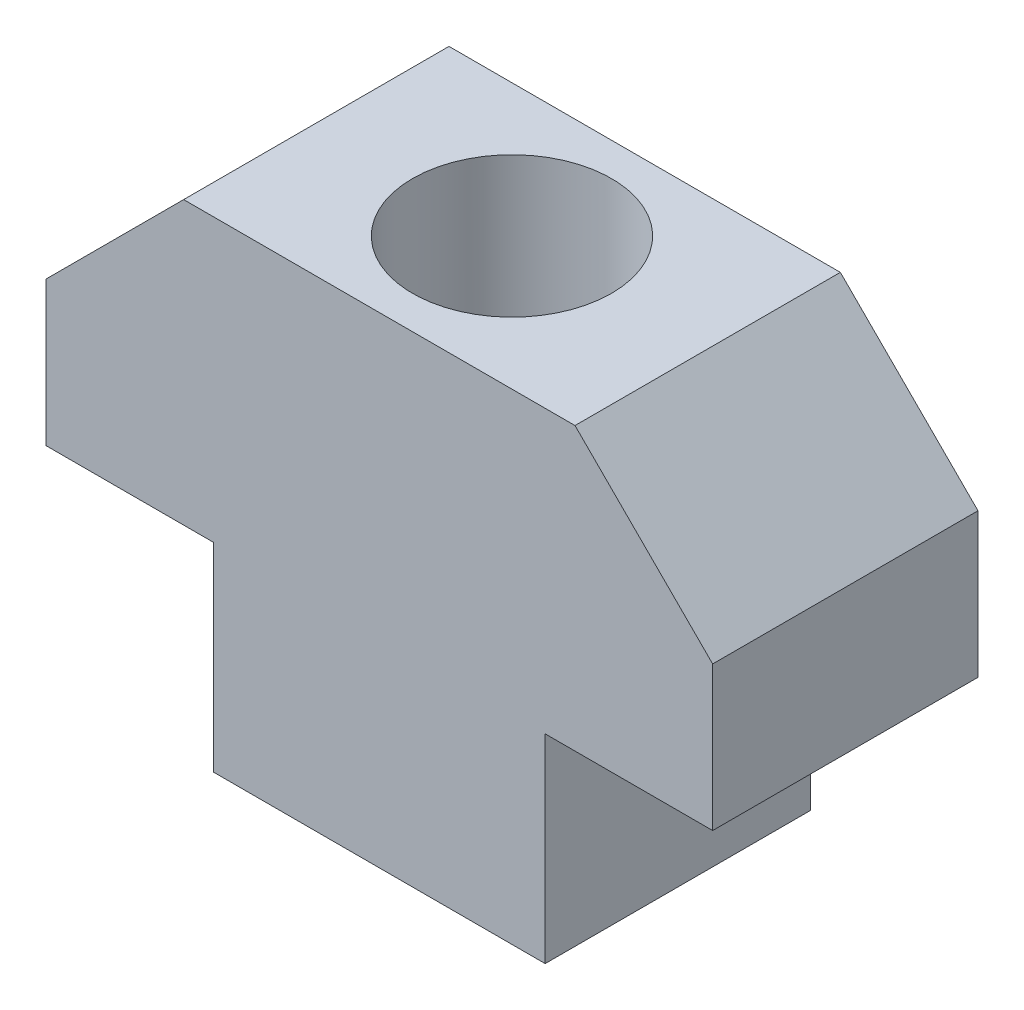
ISO-10303-21;
HEADER;
FILE_DESCRIPTION(('STEP AP214'),'2;1');
FILE_NAME('part.step','',(''),(''),'','','');
FILE_SCHEMA(('AUTOMOTIVE_DESIGN { 1 0 10303 214 1 1 1 1 }'));
ENDSEC;
DATA;
#1=APPLICATION_CONTEXT('core data for automotive mechanical design processes');
#2=APPLICATION_PROTOCOL_DEFINITION('international standard','automotive_design',2000,#1);
#3=PRODUCT_CONTEXT('',#1,'mechanical');
#4=PRODUCT('Part','Part','',(#3));
#5=PRODUCT_RELATED_PRODUCT_CATEGORY('part','',(#4));
#6=PRODUCT_DEFINITION_FORMATION('','',#4);
#7=PRODUCT_DEFINITION_CONTEXT('part definition',#1,'design');
#8=PRODUCT_DEFINITION('design','',#6,#7);
#9=PRODUCT_DEFINITION_SHAPE('','',#8);
#10=(LENGTH_UNIT() NAMED_UNIT(*) SI_UNIT(.MILLI.,.METRE.));
#11=(NAMED_UNIT(*) PLANE_ANGLE_UNIT() SI_UNIT($,.RADIAN.));
#12=(NAMED_UNIT(*) SI_UNIT($,.STERADIAN.) SOLID_ANGLE_UNIT());
#13=UNCERTAINTY_MEASURE_WITH_UNIT(LENGTH_MEASURE(1.E-05),#10,'distance_accuracy_value','');
#14=(GEOMETRIC_REPRESENTATION_CONTEXT(3) GLOBAL_UNCERTAINTY_ASSIGNED_CONTEXT((#13)) GLOBAL_UNIT_ASSIGNED_CONTEXT((#10,
#11,#12)) REPRESENTATION_CONTEXT('',''));
#15=CARTESIAN_POINT('',(0.,0.,0.));
#16=DIRECTION('',(0.,0.,1.));
#17=DIRECTION('',(1.,0.,0.));
#18=AXIS2_PLACEMENT_3D('',#15,#16,#17);
#19=CARTESIAN_POINT('',(5.9,14.5,4.));
#20=DIRECTION('',(0.,-1.,0.));
#21=DIRECTION('',(1.,0.,0.));
#22=AXIS2_PLACEMENT_3D('',#19,#20,#21);
#23=PLANE('',#22);
#24=DIRECTION('',(-1.,0.,0.));
#25=VECTOR('',#24,1.);
#26=CARTESIAN_POINT('',(5.9,14.5,-4.));
#27=LINE('',#26,#25);
#28=CARTESIAN_POINT('',(5.9,14.5,-4.));
#29=VERTEX_POINT('',#28);
#30=CARTESIAN_POINT('',(-5.9,14.5,-4.));
#31=VERTEX_POINT('',#30);
#32=EDGE_CURVE('E154',#29,#31,#27,.T.);
#33=ORIENTED_EDGE('',*,*,#32,.T.);
#34=DIRECTION('',(0.,0.,-1.));
#35=VECTOR('',#34,1.);
#36=CARTESIAN_POINT('',(-5.9,14.5,4.));
#37=LINE('',#36,#35);
#38=CARTESIAN_POINT('',(-5.9,14.5,4.));
#39=VERTEX_POINT('',#38);
#40=EDGE_CURVE('E170',#39,#31,#37,.T.);
#41=ORIENTED_EDGE('',*,*,#40,.F.);
#42=DIRECTION('',(-1.,0.,0.));
#43=VECTOR('',#42,1.);
#44=CARTESIAN_POINT('',(5.9,14.5,4.));
#45=LINE('',#44,#43);
#46=CARTESIAN_POINT('',(5.9,14.5,4.));
#47=VERTEX_POINT('',#46);
#48=EDGE_CURVE('E199',#47,#39,#45,.T.);
#49=ORIENTED_EDGE('',*,*,#48,.F.);
#50=DIRECTION('',(0.,0.,-1.));
#51=VECTOR('',#50,1.);
#52=CARTESIAN_POINT('',(5.9,14.5,4.));
#53=LINE('',#52,#51);
#54=EDGE_CURVE('E173',#47,#29,#53,.T.);
#55=ORIENTED_EDGE('',*,*,#54,.T.);
#56=EDGE_LOOP('',(#33,#41,#49,#55));
#57=FACE_BOUND('',#56,.T.);
#58=CARTESIAN_POINT('',(0.,14.5,0.));
#59=DIRECTION('',(0.,-1.,0.));
#60=DIRECTION('',(1.,0.,0.));
#61=AXIS2_PLACEMENT_3D('',#58,#59,#60);
#62=CIRCLE('',#61,3.);
#63=CARTESIAN_POINT('',(3.,14.5,0.));
#64=VERTEX_POINT('',#63);
#65=EDGE_CURVE('E210',#64,#64,#62,.T.);
#66=ORIENTED_EDGE('',*,*,#65,.T.);
#67=EDGE_LOOP('',(#66));
#68=FACE_BOUND('',#67,.T.);
#69=ADVANCED_FACE('F35',(#57,#68),#23,.F.);
#70=CARTESIAN_POINT('',(-5.,0.,4.));
#71=DIRECTION('',(0.,1.,0.));
#72=DIRECTION('',(-1.,0.,0.));
#73=AXIS2_PLACEMENT_3D('',#70,#71,#72);
#74=PLANE('',#73);
#75=DIRECTION('',(1.,0.,0.));
#76=VECTOR('',#75,1.);
#77=CARTESIAN_POINT('',(-5.,0.,-4.));
#78=LINE('',#77,#76);
#79=CARTESIAN_POINT('',(-5.,0.,-4.));
#80=VERTEX_POINT('',#79);
#81=CARTESIAN_POINT('',(5.,0.,-4.));
#82=VERTEX_POINT('',#81);
#83=EDGE_CURVE('E93',#80,#82,#78,.T.);
#84=ORIENTED_EDGE('',*,*,#83,.T.);
#85=DIRECTION('',(0.,0.,-1.));
#86=VECTOR('',#85,1.);
#87=CARTESIAN_POINT('',(5.,0.,4.));
#88=LINE('',#87,#86);
#89=CARTESIAN_POINT('',(5.,0.,4.));
#90=VERTEX_POINT('',#89);
#91=EDGE_CURVE('E140',#90,#82,#88,.T.);
#92=ORIENTED_EDGE('',*,*,#91,.F.);
#93=DIRECTION('',(1.,0.,0.));
#94=VECTOR('',#93,1.);
#95=CARTESIAN_POINT('',(-5.,0.,4.));
#96=LINE('',#95,#94);
#97=CARTESIAN_POINT('',(-5.,0.,4.));
#98=VERTEX_POINT('',#97);
#99=EDGE_CURVE('E52',#98,#90,#96,.T.);
#100=ORIENTED_EDGE('',*,*,#99,.F.);
#101=DIRECTION('',(0.,0.,-1.));
#102=VECTOR('',#101,1.);
#103=CARTESIAN_POINT('',(-5.,0.,4.));
#104=LINE('',#103,#102);
#105=EDGE_CURVE('E136',#98,#80,#104,.T.);
#106=ORIENTED_EDGE('',*,*,#105,.T.);
#107=EDGE_LOOP('',(#84,#92,#100,#106));
#108=FACE_BOUND('',#107,.T.);
#109=CARTESIAN_POINT('',(0.,0.,0.));
#110=DIRECTION('',(0.,1.,0.));
#111=DIRECTION('',(0.,0.,1.));
#112=AXIS2_PLACEMENT_3D('',#109,#110,#111);
#113=CIRCLE('',#112,3.);
#114=CARTESIAN_POINT('',(0.,0.,3.));
#115=VERTEX_POINT('',#114);
#116=EDGE_CURVE('E148',#115,#115,#113,.T.);
#117=ORIENTED_EDGE('',*,*,#116,.T.);
#118=EDGE_LOOP('',(#117));
#119=FACE_BOUND('',#118,.T.);
#120=ADVANCED_FACE('F216',(#108,#119),#74,.F.);
#121=CARTESIAN_POINT('',(5.,0.,4.));
#122=DIRECTION('',(-1.,0.,0.));
#123=DIRECTION('',(0.,0.,1.));
#124=AXIS2_PLACEMENT_3D('',#121,#122,#123);
#125=PLANE('',#124);
#126=DIRECTION('',(0.,1.,0.));
#127=VECTOR('',#126,1.);
#128=CARTESIAN_POINT('',(5.,0.,-4.));
#129=LINE('',#128,#127);
#130=CARTESIAN_POINT('',(5.,6.,-4.));
#131=VERTEX_POINT('',#130);
#132=EDGE_CURVE('E144',#82,#131,#129,.T.);
#133=ORIENTED_EDGE('',*,*,#132,.T.);
#134=DIRECTION('',(0.,0.,-1.));
#135=VECTOR('',#134,1.);
#136=CARTESIAN_POINT('',(5.,6.,4.));
#137=LINE('',#136,#135);
#138=CARTESIAN_POINT('',(5.,6.,4.));
#139=VERTEX_POINT('',#138);
#140=EDGE_CURVE('E11',#139,#131,#137,.T.);
#141=ORIENTED_EDGE('',*,*,#140,.F.);
#142=DIRECTION('',(0.,1.,0.));
#143=VECTOR('',#142,1.);
#144=CARTESIAN_POINT('',(5.,0.,4.));
#145=LINE('',#144,#143);
#146=EDGE_CURVE('E163',#90,#139,#145,.T.);
#147=ORIENTED_EDGE('',*,*,#146,.F.);
#148=ORIENTED_EDGE('',*,*,#91,.T.);
#149=EDGE_LOOP('',(#133,#141,#147,#148));
#150=FACE_BOUND('',#149,.T.);
#151=ADVANCED_FACE('F37',(#150),#125,.F.);
#152=CARTESIAN_POINT('',(5.,6.,4.));
#153=DIRECTION('',(0.,1.,0.));
#154=DIRECTION('',(-1.,0.,0.));
#155=AXIS2_PLACEMENT_3D('',#152,#153,#154);
#156=PLANE('',#155);
#157=DIRECTION('',(1.,0.,0.));
#158=VECTOR('',#157,1.);
#159=CARTESIAN_POINT('',(5.,6.,-4.));
#160=LINE('',#159,#158);
#161=CARTESIAN_POINT('',(10.05,6.,-4.));
#162=VERTEX_POINT('',#161);
#163=EDGE_CURVE('E147',#131,#162,#160,.T.);
#164=ORIENTED_EDGE('',*,*,#163,.T.);
#165=DIRECTION('',(0.,0.,-1.));
#166=VECTOR('',#165,1.);
#167=CARTESIAN_POINT('',(10.05,6.,4.));
#168=LINE('',#167,#166);
#169=CARTESIAN_POINT('',(10.05,6.,4.));
#170=VERTEX_POINT('',#169);
#171=EDGE_CURVE('E44',#170,#162,#168,.T.);
#172=ORIENTED_EDGE('',*,*,#171,.F.);
#173=DIRECTION('',(1.,0.,0.));
#174=VECTOR('',#173,1.);
#175=CARTESIAN_POINT('',(5.,6.,4.));
#176=LINE('',#175,#174);
#177=EDGE_CURVE('E101',#139,#170,#176,.T.);
#178=ORIENTED_EDGE('',*,*,#177,.F.);
#179=ORIENTED_EDGE('',*,*,#140,.T.);
#180=EDGE_LOOP('',(#164,#172,#178,#179));
#181=FACE_BOUND('',#180,.T.);
#182=ADVANCED_FACE('F236',(#181),#156,.F.);
#183=CARTESIAN_POINT('',(10.05,6.,4.));
#184=DIRECTION('',(-1.,0.,0.));
#185=DIRECTION('',(0.,0.,1.));
#186=AXIS2_PLACEMENT_3D('',#183,#184,#185);
#187=PLANE('',#186);
#188=DIRECTION('',(0.,1.,0.));
#189=VECTOR('',#188,1.);
#190=CARTESIAN_POINT('',(10.05,6.,-4.));
#191=LINE('',#190,#189);
#192=CARTESIAN_POINT('',(10.05,10.35,-4.));
#193=VERTEX_POINT('',#192);
#194=EDGE_CURVE('E150',#162,#193,#191,.T.);
#195=ORIENTED_EDGE('',*,*,#194,.T.);
#196=DIRECTION('',(0.,0.,-1.));
#197=VECTOR('',#196,1.);
#198=CARTESIAN_POINT('',(10.05,10.35,4.));
#199=LINE('',#198,#197);
#200=CARTESIAN_POINT('',(10.05,10.35,4.));
#201=VERTEX_POINT('',#200);
#202=EDGE_CURVE('E176',#201,#193,#199,.T.);
#203=ORIENTED_EDGE('',*,*,#202,.F.);
#204=DIRECTION('',(0.,1.,0.));
#205=VECTOR('',#204,1.);
#206=CARTESIAN_POINT('',(10.05,6.,4.));
#207=LINE('',#206,#205);
#208=EDGE_CURVE('E184',#170,#201,#207,.T.);
#209=ORIENTED_EDGE('',*,*,#208,.F.);
#210=ORIENTED_EDGE('',*,*,#171,.T.);
#211=EDGE_LOOP('',(#195,#203,#209,#210));
#212=FACE_BOUND('',#211,.T.);
#213=ADVANCED_FACE('F182',(#212),#187,.F.);
#214=CARTESIAN_POINT('',(10.05,10.35,4.));
#215=DIRECTION('',(-0.707106781186549,-0.707106781186546,0.));
#216=DIRECTION('',(0.707106781186546,-0.707106781186549,0.));
#217=AXIS2_PLACEMENT_3D('',#214,#215,#216);
#218=PLANE('',#217);
#219=DIRECTION('',(-0.707106781186546,0.707106781186549,0.));
#220=VECTOR('',#219,1.);
#221=CARTESIAN_POINT('',(10.05,10.35,-4.));
#222=LINE('',#221,#220);
#223=EDGE_CURVE('E152',#193,#29,#222,.T.);
#224=ORIENTED_EDGE('',*,*,#223,.T.);
#225=ORIENTED_EDGE('',*,*,#54,.F.);
#226=DIRECTION('',(-0.707106781186546,0.707106781186549,0.));
#227=VECTOR('',#226,1.);
#228=CARTESIAN_POINT('',(10.05,10.35,4.));
#229=LINE('',#228,#227);
#230=EDGE_CURVE('E202',#201,#47,#229,.T.);
#231=ORIENTED_EDGE('',*,*,#230,.F.);
#232=ORIENTED_EDGE('',*,*,#202,.T.);
#233=EDGE_LOOP('',(#224,#225,#231,#232));
#234=FACE_BOUND('',#233,.T.);
#235=ADVANCED_FACE('F193',(#234),#218,.F.);
#236=CARTESIAN_POINT('',(-5.9,14.5,4.));
#237=DIRECTION('',(0.707106781186549,-0.707106781186546,0.));
#238=DIRECTION('',(0.707106781186546,0.707106781186549,0.));
#239=AXIS2_PLACEMENT_3D('',#236,#237,#238);
#240=PLANE('',#239);
#241=DIRECTION('',(-0.707106781186546,-0.707106781186549,0.));
#242=VECTOR('',#241,1.);
#243=CARTESIAN_POINT('',(-5.9,14.5,-4.));
#244=LINE('',#243,#242);
#245=CARTESIAN_POINT('',(-10.05,10.35,-4.));
#246=VERTEX_POINT('',#245);
#247=EDGE_CURVE('E156',#31,#246,#244,.T.);
#248=ORIENTED_EDGE('',*,*,#247,.T.);
#249=DIRECTION('',(0.,0.,-1.));
#250=VECTOR('',#249,1.);
#251=CARTESIAN_POINT('',(-10.05,10.35,4.));
#252=LINE('',#251,#250);
#253=CARTESIAN_POINT('',(-10.05,10.35,4.));
#254=VERTEX_POINT('',#253);
#255=EDGE_CURVE('E167',#254,#246,#252,.T.);
#256=ORIENTED_EDGE('',*,*,#255,.F.);
#257=DIRECTION('',(-0.707106781186546,-0.707106781186549,0.));
#258=VECTOR('',#257,1.);
#259=CARTESIAN_POINT('',(-5.9,14.5,4.));
#260=LINE('',#259,#258);
#261=EDGE_CURVE('E201',#39,#254,#260,.T.);
#262=ORIENTED_EDGE('',*,*,#261,.F.);
#263=ORIENTED_EDGE('',*,*,#40,.T.);
#264=EDGE_LOOP('',(#248,#256,#262,#263));
#265=FACE_BOUND('',#264,.T.);
#266=ADVANCED_FACE('F231',(#265),#240,.F.);
#267=CARTESIAN_POINT('',(-10.05,10.35,4.));
#268=DIRECTION('',(1.,0.,0.));
#269=DIRECTION('',(0.,0.,-1.));
#270=AXIS2_PLACEMENT_3D('',#267,#268,#269);
#271=PLANE('',#270);
#272=DIRECTION('',(0.,-1.,0.));
#273=VECTOR('',#272,1.);
#274=CARTESIAN_POINT('',(-10.05,10.35,-4.));
#275=LINE('',#274,#273);
#276=CARTESIAN_POINT('',(-10.05,6.,-4.));
#277=VERTEX_POINT('',#276);
#278=EDGE_CURVE('E158',#246,#277,#275,.T.);
#279=ORIENTED_EDGE('',*,*,#278,.T.);
#280=DIRECTION('',(0.,0.,-1.));
#281=VECTOR('',#280,1.);
#282=CARTESIAN_POINT('',(-10.05,6.,4.));
#283=LINE('',#282,#281);
#284=CARTESIAN_POINT('',(-10.05,6.,4.));
#285=VERTEX_POINT('',#284);
#286=EDGE_CURVE('E135',#285,#277,#283,.T.);
#287=ORIENTED_EDGE('',*,*,#286,.F.);
#288=DIRECTION('',(0.,-1.,0.));
#289=VECTOR('',#288,1.);
#290=CARTESIAN_POINT('',(-10.05,10.35,4.));
#291=LINE('',#290,#289);
#292=EDGE_CURVE('E126',#254,#285,#291,.T.);
#293=ORIENTED_EDGE('',*,*,#292,.F.);
#294=ORIENTED_EDGE('',*,*,#255,.T.);
#295=EDGE_LOOP('',(#279,#287,#293,#294));
#296=FACE_BOUND('',#295,.T.);
#297=ADVANCED_FACE('F246',(#296),#271,.F.);
#298=CARTESIAN_POINT('',(-10.05,6.,4.));
#299=DIRECTION('',(0.,1.,0.));
#300=DIRECTION('',(0.,0.,1.));
#301=AXIS2_PLACEMENT_3D('',#298,#299,#300);
#302=PLANE('',#301);
#303=DIRECTION('',(1.,0.,0.));
#304=VECTOR('',#303,1.);
#305=CARTESIAN_POINT('',(-10.05,6.,-4.));
#306=LINE('',#305,#304);
#307=CARTESIAN_POINT('',(-5.,6.,-4.));
#308=VERTEX_POINT('',#307);
#309=EDGE_CURVE('E134',#277,#308,#306,.T.);
#310=ORIENTED_EDGE('',*,*,#309,.T.);
#311=DIRECTION('',(0.,0.,-1.));
#312=VECTOR('',#311,1.);
#313=CARTESIAN_POINT('',(-5.,6.,4.));
#314=LINE('',#313,#312);
#315=CARTESIAN_POINT('',(-5.,6.,4.));
#316=VERTEX_POINT('',#315);
#317=EDGE_CURVE('E131',#316,#308,#314,.T.);
#318=ORIENTED_EDGE('',*,*,#317,.F.);
#319=DIRECTION('',(1.,0.,0.));
#320=VECTOR('',#319,1.);
#321=CARTESIAN_POINT('',(-10.05,6.,4.));
#322=LINE('',#321,#320);
#323=EDGE_CURVE('E120',#285,#316,#322,.T.);
#324=ORIENTED_EDGE('',*,*,#323,.F.);
#325=ORIENTED_EDGE('',*,*,#286,.T.);
#326=EDGE_LOOP('',(#310,#318,#324,#325));
#327=FACE_BOUND('',#326,.T.);
#328=ADVANCED_FACE('F132',(#327),#302,.F.);
#329=CARTESIAN_POINT('',(-5.,6.,4.));
#330=DIRECTION('',(1.,0.,0.));
#331=DIRECTION('',(0.,1.,0.));
#332=AXIS2_PLACEMENT_3D('',#329,#330,#331);
#333=PLANE('',#332);
#334=DIRECTION('',(0.,-1.,0.));
#335=VECTOR('',#334,1.);
#336=CARTESIAN_POINT('',(-5.,6.,-4.));
#337=LINE('',#336,#335);
#338=EDGE_CURVE('E87',#308,#80,#337,.T.);
#339=ORIENTED_EDGE('',*,*,#338,.T.);
#340=ORIENTED_EDGE('',*,*,#105,.F.);
#341=DIRECTION('',(0.,-1.,0.));
#342=VECTOR('',#341,1.);
#343=CARTESIAN_POINT('',(-5.,6.,4.));
#344=LINE('',#343,#342);
#345=EDGE_CURVE('E124',#316,#98,#344,.T.);
#346=ORIENTED_EDGE('',*,*,#345,.F.);
#347=ORIENTED_EDGE('',*,*,#317,.T.);
#348=EDGE_LOOP('',(#339,#340,#346,#347));
#349=FACE_BOUND('',#348,.T.);
#350=ADVANCED_FACE('F138',(#349),#333,.F.);
#351=CARTESIAN_POINT('',(5.,6.,4.));
#352=DIRECTION('',(0.,0.,-1.));
#353=DIRECTION('',(-1.,0.,0.));
#354=AXIS2_PLACEMENT_3D('',#351,#352,#353);
#355=PLANE('',#354);
#356=ORIENTED_EDGE('',*,*,#146,.T.);
#357=ORIENTED_EDGE('',*,*,#177,.T.);
#358=ORIENTED_EDGE('',*,*,#208,.T.);
#359=ORIENTED_EDGE('',*,*,#230,.T.);
#360=ORIENTED_EDGE('',*,*,#48,.T.);
#361=ORIENTED_EDGE('',*,*,#261,.T.);
#362=ORIENTED_EDGE('',*,*,#292,.T.);
#363=ORIENTED_EDGE('',*,*,#323,.T.);
#364=ORIENTED_EDGE('',*,*,#345,.T.);
#365=ORIENTED_EDGE('',*,*,#99,.T.);
#366=EDGE_LOOP('',(#356,#357,#358,#359,#360,#361,#362,#363,#364,#365));
#367=FACE_BOUND('',#366,.T.);
#368=ADVANCED_FACE('F122',(#367),#355,.F.);
#369=CARTESIAN_POINT('',(5.,6.,-4.));
#370=DIRECTION('',(0.,0.,-1.));
#371=DIRECTION('',(-1.,0.,0.));
#372=AXIS2_PLACEMENT_3D('',#369,#370,#371);
#373=PLANE('',#372);
#374=ORIENTED_EDGE('',*,*,#132,.F.);
#375=ORIENTED_EDGE('',*,*,#83,.F.);
#376=ORIENTED_EDGE('',*,*,#338,.F.);
#377=ORIENTED_EDGE('',*,*,#309,.F.);
#378=ORIENTED_EDGE('',*,*,#278,.F.);
#379=ORIENTED_EDGE('',*,*,#247,.F.);
#380=ORIENTED_EDGE('',*,*,#32,.F.);
#381=ORIENTED_EDGE('',*,*,#223,.F.);
#382=ORIENTED_EDGE('',*,*,#194,.F.);
#383=ORIENTED_EDGE('',*,*,#163,.F.);
#384=EDGE_LOOP('',(#374,#375,#376,#377,#378,#379,#380,#381,#382,#383));
#385=FACE_BOUND('',#384,.T.);
#386=ADVANCED_FACE('F188',(#385),#373,.T.);
#387=CARTESIAN_POINT('',(0.,14.501,0.));
#388=DIRECTION('',(0.,-1.,0.));
#389=DIRECTION('',(0.,0.,-1.));
#390=AXIS2_PLACEMENT_3D('',#387,#388,#389);
#391=CYLINDRICAL_SURFACE('',#390,3.);
#392=ORIENTED_EDGE('',*,*,#116,.F.);
#393=EDGE_LOOP('',(#392));
#394=FACE_BOUND('',#393,.T.);
#395=ORIENTED_EDGE('',*,*,#65,.F.);
#396=EDGE_LOOP('',(#395));
#397=FACE_BOUND('',#396,.T.);
#398=ADVANCED_FACE('F218',(#394,#397),#391,.F.);
#399=CLOSED_SHELL('',(#69,#120,#151,#182,#213,#235,#266,#297,#328,#350,#368,#386,#398));
#400=MANIFOLD_SOLID_BREP('B2',#399);
#401=ADVANCED_BREP_SHAPE_REPRESENTATION('',(#18,#400),#14);
#402=SHAPE_DEFINITION_REPRESENTATION(#9,#401);
ENDSEC;
END-ISO-10303-21;
